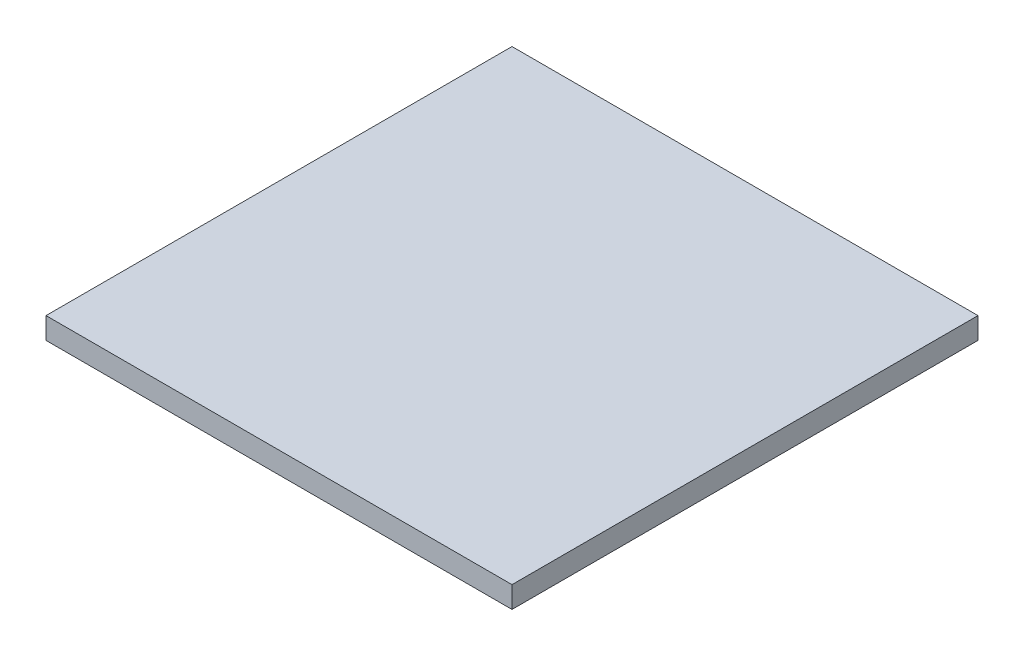
ISO-10303-21;
HEADER;
FILE_DESCRIPTION(('STEP AP214'),'2;1');
FILE_NAME('part.step','',(''),(''),'','','');
FILE_SCHEMA(('AUTOMOTIVE_DESIGN { 1 0 10303 214 1 1 1 1 }'));
ENDSEC;
DATA;
#1=APPLICATION_CONTEXT('core data for automotive mechanical design processes');
#2=APPLICATION_PROTOCOL_DEFINITION('international standard','automotive_design',2000,#1);
#3=PRODUCT_CONTEXT('',#1,'mechanical');
#4=PRODUCT('Part','Part','',(#3));
#5=PRODUCT_RELATED_PRODUCT_CATEGORY('part','',(#4));
#6=PRODUCT_DEFINITION_FORMATION('','',#4);
#7=PRODUCT_DEFINITION_CONTEXT('part definition',#1,'design');
#8=PRODUCT_DEFINITION('design','',#6,#7);
#9=PRODUCT_DEFINITION_SHAPE('','',#8);
#10=(LENGTH_UNIT() NAMED_UNIT(*) SI_UNIT(.MILLI.,.METRE.));
#11=(NAMED_UNIT(*) PLANE_ANGLE_UNIT() SI_UNIT($,.RADIAN.));
#12=(NAMED_UNIT(*) SI_UNIT($,.STERADIAN.) SOLID_ANGLE_UNIT());
#13=UNCERTAINTY_MEASURE_WITH_UNIT(LENGTH_MEASURE(1.E-05),#10,'distance_accuracy_value','');
#14=(GEOMETRIC_REPRESENTATION_CONTEXT(3) GLOBAL_UNCERTAINTY_ASSIGNED_CONTEXT((#13)) GLOBAL_UNIT_ASSIGNED_CONTEXT((#10,
#11,#12)) REPRESENTATION_CONTEXT('',''));
#15=CARTESIAN_POINT('',(0.,0.,0.));
#16=DIRECTION('',(0.,0.,1.));
#17=DIRECTION('',(1.,0.,0.));
#18=AXIS2_PLACEMENT_3D('',#15,#16,#17);
#19=CARTESIAN_POINT('',(46.8413827296016,35.4384983767566,197.14756588166));
#20=DIRECTION('',(0.,1.,0.));
#21=DIRECTION('',(0.,0.,1.));
#22=AXIS2_PLACEMENT_3D('',#19,#20,#21);
#23=PLANE('',#22);
#24=DIRECTION('',(0.,0.,-1.));
#25=VECTOR('',#24,1.);
#26=CARTESIAN_POINT('',(30.3313827296016,35.4384983767566,180.63756588166));
#27=LINE('',#26,#25);
#28=CARTESIAN_POINT('',(30.3313827296016,35.4384983767566,213.65756588166));
#29=VERTEX_POINT('',#28);
#30=CARTESIAN_POINT('',(30.3313827296016,35.4384983767566,180.63756588166));
#31=VERTEX_POINT('',#30);
#32=EDGE_CURVE('E20',#29,#31,#27,.T.);
#33=ORIENTED_EDGE('',*,*,#32,.T.);
#34=DIRECTION('',(1.,0.,0.));
#35=VECTOR('',#34,1.);
#36=CARTESIAN_POINT('',(30.3313827296016,35.4384983767566,180.63756588166));
#37=LINE('',#36,#35);
#38=CARTESIAN_POINT('',(63.3513827296016,35.4384983767566,180.63756588166));
#39=VERTEX_POINT('',#38);
#40=EDGE_CURVE('E88',#31,#39,#37,.T.);
#41=ORIENTED_EDGE('',*,*,#40,.T.);
#42=DIRECTION('',(0.,0.,1.));
#43=VECTOR('',#42,1.);
#44=CARTESIAN_POINT('',(63.3513827296016,35.4384983767566,180.63756588166));
#45=LINE('',#44,#43);
#46=CARTESIAN_POINT('',(63.3513827296016,35.4384983767566,213.65756588166));
#47=VERTEX_POINT('',#46);
#48=EDGE_CURVE('E56',#39,#47,#45,.T.);
#49=ORIENTED_EDGE('',*,*,#48,.T.);
#50=DIRECTION('',(-1.,0.,0.));
#51=VECTOR('',#50,1.);
#52=CARTESIAN_POINT('',(30.3313827296016,35.4384983767566,213.65756588166));
#53=LINE('',#52,#51);
#54=EDGE_CURVE('E58',#47,#29,#53,.T.);
#55=ORIENTED_EDGE('',*,*,#54,.T.);
#56=EDGE_LOOP('',(#33,#41,#49,#55));
#57=FACE_BOUND('',#56,.T.);
#58=ADVANCED_FACE('F17',(#57),#23,.F.);
#59=CARTESIAN_POINT('',(30.3313827296016,36.9624983767565,180.63756588166));
#60=DIRECTION('',(1.,0.,0.));
#61=DIRECTION('',(0.,0.,-1.));
#62=AXIS2_PLACEMENT_3D('',#59,#60,#61);
#63=PLANE('',#62);
#64=DIRECTION('',(0.,0.,1.));
#65=VECTOR('',#64,1.);
#66=CARTESIAN_POINT('',(30.3313827296016,36.9624983767565,197.14756588166));
#67=LINE('',#66,#65);
#68=CARTESIAN_POINT('',(30.3313827296016,36.9624983767565,180.63756588166));
#69=VERTEX_POINT('',#68);
#70=CARTESIAN_POINT('',(30.3313827296016,36.9624983767565,213.65756588166));
#71=VERTEX_POINT('',#70);
#72=EDGE_CURVE('E93',#69,#71,#67,.T.);
#73=ORIENTED_EDGE('',*,*,#72,.F.);
#74=DIRECTION('',(0.,1.,0.));
#75=VECTOR('',#74,1.);
#76=CARTESIAN_POINT('',(30.3313827296016,36.9624983767565,180.63756588166));
#77=LINE('',#76,#75);
#78=EDGE_CURVE('E70',#69,#31,#77,.F.);
#79=ORIENTED_EDGE('',*,*,#78,.T.);
#80=ORIENTED_EDGE('',*,*,#32,.F.);
#81=DIRECTION('',(0.,1.,0.));
#82=VECTOR('',#81,1.);
#83=CARTESIAN_POINT('',(30.3313827296016,36.9624983767565,213.65756588166));
#84=LINE('',#83,#82);
#85=EDGE_CURVE('E65',#29,#71,#84,.T.);
#86=ORIENTED_EDGE('',*,*,#85,.T.);
#87=EDGE_LOOP('',(#73,#79,#80,#86));
#88=FACE_BOUND('',#87,.T.);
#89=ADVANCED_FACE('F67',(#88),#63,.F.);
#90=CARTESIAN_POINT('',(30.3313827296016,36.9624983767565,213.65756588166));
#91=DIRECTION('',(0.,0.,-1.));
#92=DIRECTION('',(-1.,0.,0.));
#93=AXIS2_PLACEMENT_3D('',#90,#91,#92);
#94=PLANE('',#93);
#95=DIRECTION('',(1.,0.,0.));
#96=VECTOR('',#95,1.);
#97=CARTESIAN_POINT('',(46.8413827296016,36.9624983767565,213.65756588166));
#98=LINE('',#97,#96);
#99=CARTESIAN_POINT('',(63.3513827296016,36.9624983767565,213.65756588166));
#100=VERTEX_POINT('',#99);
#101=EDGE_CURVE('E75',#71,#100,#98,.T.);
#102=ORIENTED_EDGE('',*,*,#101,.F.);
#103=ORIENTED_EDGE('',*,*,#85,.F.);
#104=ORIENTED_EDGE('',*,*,#54,.F.);
#105=DIRECTION('',(0.,1.,0.));
#106=VECTOR('',#105,1.);
#107=CARTESIAN_POINT('',(63.3513827296016,36.9624983767565,213.65756588166));
#108=LINE('',#107,#106);
#109=EDGE_CURVE('E83',#47,#100,#108,.T.);
#110=ORIENTED_EDGE('',*,*,#109,.T.);
#111=EDGE_LOOP('',(#102,#103,#104,#110));
#112=FACE_BOUND('',#111,.T.);
#113=ADVANCED_FACE('F73',(#112),#94,.F.);
#114=CARTESIAN_POINT('',(63.3513827296016,36.9624983767565,180.63756588166));
#115=DIRECTION('',(-1.,0.,0.));
#116=DIRECTION('',(0.,0.,1.));
#117=AXIS2_PLACEMENT_3D('',#114,#115,#116);
#118=PLANE('',#117);
#119=DIRECTION('',(0.,0.,1.));
#120=VECTOR('',#119,1.);
#121=CARTESIAN_POINT('',(63.3513827296016,36.9624983767565,197.14756588166));
#122=LINE('',#121,#120);
#123=CARTESIAN_POINT('',(63.3513827296016,36.9624983767565,180.63756588166));
#124=VERTEX_POINT('',#123);
#125=EDGE_CURVE('E27',#100,#124,#122,.F.);
#126=ORIENTED_EDGE('',*,*,#125,.F.);
#127=ORIENTED_EDGE('',*,*,#109,.F.);
#128=ORIENTED_EDGE('',*,*,#48,.F.);
#129=DIRECTION('',(0.,1.,0.));
#130=VECTOR('',#129,1.);
#131=CARTESIAN_POINT('',(63.3513827296016,36.9624983767565,180.63756588166));
#132=LINE('',#131,#130);
#133=EDGE_CURVE('E36',#39,#124,#132,.T.);
#134=ORIENTED_EDGE('',*,*,#133,.T.);
#135=EDGE_LOOP('',(#126,#127,#128,#134));
#136=FACE_BOUND('',#135,.T.);
#137=ADVANCED_FACE('F102',(#136),#118,.F.);
#138=CARTESIAN_POINT('',(30.3313827296016,36.9624983767565,180.63756588166));
#139=DIRECTION('',(0.,0.,1.));
#140=DIRECTION('',(1.,0.,0.));
#141=AXIS2_PLACEMENT_3D('',#138,#139,#140);
#142=PLANE('',#141);
#143=DIRECTION('',(1.,0.,0.));
#144=VECTOR('',#143,1.);
#145=CARTESIAN_POINT('',(46.8413827296016,36.9624983767565,180.63756588166));
#146=LINE('',#145,#144);
#147=EDGE_CURVE('E11',#124,#69,#146,.F.);
#148=ORIENTED_EDGE('',*,*,#147,.F.);
#149=ORIENTED_EDGE('',*,*,#133,.F.);
#150=ORIENTED_EDGE('',*,*,#40,.F.);
#151=ORIENTED_EDGE('',*,*,#78,.F.);
#152=EDGE_LOOP('',(#148,#149,#150,#151));
#153=FACE_BOUND('',#152,.T.);
#154=ADVANCED_FACE('F104',(#153),#142,.F.);
#155=CARTESIAN_POINT('',(46.8413827296016,36.9624983767565,197.14756588166));
#156=DIRECTION('',(0.,1.,0.));
#157=DIRECTION('',(0.,0.,1.));
#158=AXIS2_PLACEMENT_3D('',#155,#156,#157);
#159=PLANE('',#158);
#160=ORIENTED_EDGE('',*,*,#125,.T.);
#161=ORIENTED_EDGE('',*,*,#147,.T.);
#162=ORIENTED_EDGE('',*,*,#72,.T.);
#163=ORIENTED_EDGE('',*,*,#101,.T.);
#164=EDGE_LOOP('',(#160,#161,#162,#163));
#165=FACE_BOUND('',#164,.T.);
#166=ADVANCED_FACE('F101',(#165),#159,.T.);
#167=CLOSED_SHELL('',(#58,#89,#113,#137,#154,#166));
#168=MANIFOLD_SOLID_BREP('B1',#167);
#169=ADVANCED_BREP_SHAPE_REPRESENTATION('',(#18,#168),#14);
#170=SHAPE_DEFINITION_REPRESENTATION(#9,#169);
ENDSEC;
END-ISO-10303-21;
